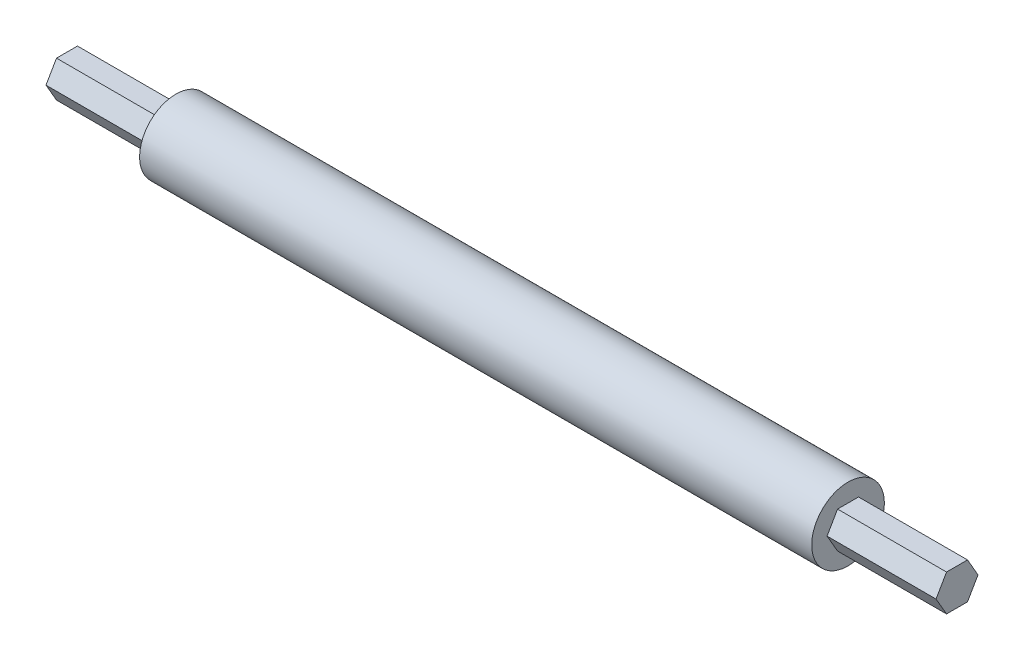
ISO-10303-21;
HEADER;
FILE_DESCRIPTION(('STEP AP214'),'2;1');
FILE_NAME('part.step','',(''),(''),'','','');
FILE_SCHEMA(('AUTOMOTIVE_DESIGN { 1 0 10303 214 1 1 1 1 }'));
ENDSEC;
DATA;
#1=APPLICATION_CONTEXT('core data for automotive mechanical design processes');
#2=APPLICATION_PROTOCOL_DEFINITION('international standard','automotive_design',2000,#1);
#3=PRODUCT_CONTEXT('',#1,'mechanical');
#4=PRODUCT('Part','Part','',(#3));
#5=PRODUCT_RELATED_PRODUCT_CATEGORY('part','',(#4));
#6=PRODUCT_DEFINITION_FORMATION('','',#4);
#7=PRODUCT_DEFINITION_CONTEXT('part definition',#1,'design');
#8=PRODUCT_DEFINITION('design','',#6,#7);
#9=PRODUCT_DEFINITION_SHAPE('','',#8);
#10=(LENGTH_UNIT() NAMED_UNIT(*) SI_UNIT(.MILLI.,.METRE.));
#11=(NAMED_UNIT(*) PLANE_ANGLE_UNIT() SI_UNIT($,.RADIAN.));
#12=(NAMED_UNIT(*) SI_UNIT($,.STERADIAN.) SOLID_ANGLE_UNIT());
#13=UNCERTAINTY_MEASURE_WITH_UNIT(LENGTH_MEASURE(1.E-05),#10,'distance_accuracy_value','');
#14=(GEOMETRIC_REPRESENTATION_CONTEXT(3) GLOBAL_UNCERTAINTY_ASSIGNED_CONTEXT((#13)) GLOBAL_UNIT_ASSIGNED_CONTEXT((#10,
#11,#12)) REPRESENTATION_CONTEXT('',''));
#15=CARTESIAN_POINT('',(0.,0.,0.));
#16=DIRECTION('',(0.,0.,1.));
#17=DIRECTION('',(1.,0.,0.));
#18=AXIS2_PLACEMENT_3D('',#15,#16,#17);
#19=CARTESIAN_POINT('',(155.575,0.,-7.33234841870825));
#20=DIRECTION('',(0.,-0.5,0.866025403784439));
#21=DIRECTION('',(0.,-0.866025403784439,-0.5));
#22=AXIS2_PLACEMENT_3D('',#19,#20,#21);
#23=PLANE('',#22);
#24=DIRECTION('',(-1.,0.,0.));
#25=VECTOR('',#24,1.);
#26=CARTESIAN_POINT('',(155.575,0.,-7.33234841870825));
#27=LINE('',#26,#25);
#28=CARTESIAN_POINT('',(155.575,0.,-7.33234841870825));
#29=VERTEX_POINT('',#28);
#30=CARTESIAN_POINT('',(117.475,0.,-7.33234841870825));
#31=VERTEX_POINT('',#30);
#32=EDGE_CURVE('E149',#29,#31,#27,.T.);
#33=ORIENTED_EDGE('',*,*,#32,.T.);
#34=DIRECTION('',(0.,0.866025403784439,0.5));
#35=VECTOR('',#34,1.);
#36=CARTESIAN_POINT('',(117.475,0.,-7.33234841870825));
#37=LINE('',#36,#35);
#38=CARTESIAN_POINT('',(117.475,6.35,-3.66617420935413));
#39=VERTEX_POINT('',#38);
#40=EDGE_CURVE('E214',#31,#39,#37,.T.);
#41=ORIENTED_EDGE('',*,*,#40,.T.);
#42=DIRECTION('',(-1.,0.,0.));
#43=VECTOR('',#42,1.);
#44=CARTESIAN_POINT('',(155.575,6.35,-3.66617420935413));
#45=LINE('',#44,#43);
#46=CARTESIAN_POINT('',(155.575,6.35,-3.66617420935413));
#47=VERTEX_POINT('',#46);
#48=EDGE_CURVE('E165',#47,#39,#45,.T.);
#49=ORIENTED_EDGE('',*,*,#48,.F.);
#50=DIRECTION('',(0.,0.866025403784439,0.5));
#51=VECTOR('',#50,1.);
#52=CARTESIAN_POINT('',(155.575,0.,-7.33234841870825));
#53=LINE('',#52,#51);
#54=EDGE_CURVE('E194',#29,#47,#53,.T.);
#55=ORIENTED_EDGE('',*,*,#54,.F.);
#56=EDGE_LOOP('',(#33,#41,#49,#55));
#57=FACE_BOUND('',#56,.T.);
#58=ADVANCED_FACE('F49',(#57),#23,.F.);
#59=CARTESIAN_POINT('',(155.575,6.35,-3.66617420935413));
#60=DIRECTION('',(0.,-1.,0.));
#61=DIRECTION('',(0.,0.,-1.));
#62=AXIS2_PLACEMENT_3D('',#59,#60,#61);
#63=PLANE('',#62);
#64=ORIENTED_EDGE('',*,*,#48,.T.);
#65=DIRECTION('',(0.,0.,1.));
#66=VECTOR('',#65,1.);
#67=CARTESIAN_POINT('',(117.475,6.35,-3.66617420935413));
#68=LINE('',#67,#66);
#69=CARTESIAN_POINT('',(117.475,6.35,3.66617420935412));
#70=VERTEX_POINT('',#69);
#71=EDGE_CURVE('E235',#39,#70,#68,.T.);
#72=ORIENTED_EDGE('',*,*,#71,.T.);
#73=DIRECTION('',(-1.,0.,0.));
#74=VECTOR('',#73,1.);
#75=CARTESIAN_POINT('',(155.575,6.35,3.66617420935412));
#76=LINE('',#75,#74);
#77=CARTESIAN_POINT('',(155.575,6.35,3.66617420935412));
#78=VERTEX_POINT('',#77);
#79=EDGE_CURVE('E170',#78,#70,#76,.T.);
#80=ORIENTED_EDGE('',*,*,#79,.F.);
#81=DIRECTION('',(0.,0.,1.));
#82=VECTOR('',#81,1.);
#83=CARTESIAN_POINT('',(155.575,6.35,-3.66617420935413));
#84=LINE('',#83,#82);
#85=EDGE_CURVE('E226',#47,#78,#84,.T.);
#86=ORIENTED_EDGE('',*,*,#85,.F.);
#87=EDGE_LOOP('',(#64,#72,#80,#86));
#88=FACE_BOUND('',#87,.T.);
#89=ADVANCED_FACE('F286',(#88),#63,.F.);
#90=CARTESIAN_POINT('',(155.575,6.35,3.66617420935412));
#91=DIRECTION('',(0.,-0.5,-0.866025403784438));
#92=DIRECTION('',(0.,0.866025403784439,-0.5));
#93=AXIS2_PLACEMENT_3D('',#90,#91,#92);
#94=PLANE('',#93);
#95=ORIENTED_EDGE('',*,*,#79,.T.);
#96=DIRECTION('',(0.,-0.866025403784439,0.5));
#97=VECTOR('',#96,1.);
#98=CARTESIAN_POINT('',(117.475,6.35,3.66617420935412));
#99=LINE('',#98,#97);
#100=CARTESIAN_POINT('',(117.475,0.,7.33234841870825));
#101=VERTEX_POINT('',#100);
#102=EDGE_CURVE('E239',#70,#101,#99,.T.);
#103=ORIENTED_EDGE('',*,*,#102,.T.);
#104=DIRECTION('',(-1.,0.,0.));
#105=VECTOR('',#104,1.);
#106=CARTESIAN_POINT('',(155.575,0.,7.33234841870825));
#107=LINE('',#106,#105);
#108=CARTESIAN_POINT('',(155.575,0.,7.33234841870825));
#109=VERTEX_POINT('',#108);
#110=EDGE_CURVE('E175',#109,#101,#107,.T.);
#111=ORIENTED_EDGE('',*,*,#110,.F.);
#112=DIRECTION('',(0.,-0.866025403784438,0.5));
#113=VECTOR('',#112,1.);
#114=CARTESIAN_POINT('',(155.575,6.35,3.66617420935412));
#115=LINE('',#114,#113);
#116=EDGE_CURVE('E223',#78,#109,#115,.T.);
#117=ORIENTED_EDGE('',*,*,#116,.F.);
#118=EDGE_LOOP('',(#95,#103,#111,#117));
#119=FACE_BOUND('',#118,.T.);
#120=ADVANCED_FACE('F292',(#119),#94,.F.);
#121=CARTESIAN_POINT('',(155.575,0.,7.33234841870825));
#122=DIRECTION('',(0.,0.5,-0.866025403784439));
#123=DIRECTION('',(0.,0.866025403784439,0.5));
#124=AXIS2_PLACEMENT_3D('',#121,#122,#123);
#125=PLANE('',#124);
#126=ORIENTED_EDGE('',*,*,#110,.T.);
#127=DIRECTION('',(0.,-0.866025403784439,-0.5));
#128=VECTOR('',#127,1.);
#129=CARTESIAN_POINT('',(117.475,0.,7.33234841870825));
#130=LINE('',#129,#128);
#131=CARTESIAN_POINT('',(117.475,-6.35,3.66617420935413));
#132=VERTEX_POINT('',#131);
#133=EDGE_CURVE('E243',#101,#132,#130,.T.);
#134=ORIENTED_EDGE('',*,*,#133,.T.);
#135=DIRECTION('',(-1.,0.,0.));
#136=VECTOR('',#135,1.);
#137=CARTESIAN_POINT('',(155.575,-6.35,3.66617420935413));
#138=LINE('',#137,#136);
#139=CARTESIAN_POINT('',(155.575,-6.35,3.66617420935413));
#140=VERTEX_POINT('',#139);
#141=EDGE_CURVE('E180',#140,#132,#138,.T.);
#142=ORIENTED_EDGE('',*,*,#141,.F.);
#143=DIRECTION('',(0.,-0.866025403784439,-0.5));
#144=VECTOR('',#143,1.);
#145=CARTESIAN_POINT('',(155.575,0.,7.33234841870825));
#146=LINE('',#145,#144);
#147=EDGE_CURVE('E220',#109,#140,#146,.T.);
#148=ORIENTED_EDGE('',*,*,#147,.F.);
#149=EDGE_LOOP('',(#126,#134,#142,#148));
#150=FACE_BOUND('',#149,.T.);
#151=ADVANCED_FACE('F307',(#150),#125,.F.);
#152=CARTESIAN_POINT('',(155.575,-6.35,3.66617420935413));
#153=DIRECTION('',(0.,1.,0.));
#154=DIRECTION('',(0.,0.,1.));
#155=AXIS2_PLACEMENT_3D('',#152,#153,#154);
#156=PLANE('',#155);
#157=ORIENTED_EDGE('',*,*,#141,.T.);
#158=DIRECTION('',(0.,0.,-1.));
#159=VECTOR('',#158,1.);
#160=CARTESIAN_POINT('',(117.475,-6.35,3.66617420935413));
#161=LINE('',#160,#159);
#162=CARTESIAN_POINT('',(117.475,-6.35,-3.66617420935412));
#163=VERTEX_POINT('',#162);
#164=EDGE_CURVE('E158',#132,#163,#161,.T.);
#165=ORIENTED_EDGE('',*,*,#164,.T.);
#166=DIRECTION('',(-1.,0.,0.));
#167=VECTOR('',#166,1.);
#168=CARTESIAN_POINT('',(155.575,-6.35,-3.66617420935412));
#169=LINE('',#168,#167);
#170=CARTESIAN_POINT('',(155.575,-6.35,-3.66617420935412));
#171=VERTEX_POINT('',#170);
#172=EDGE_CURVE('E185',#171,#163,#169,.T.);
#173=ORIENTED_EDGE('',*,*,#172,.F.);
#174=DIRECTION('',(0.,0.,-1.));
#175=VECTOR('',#174,1.);
#176=CARTESIAN_POINT('',(155.575,-6.35,3.66617420935413));
#177=LINE('',#176,#175);
#178=EDGE_CURVE('E217',#140,#171,#177,.T.);
#179=ORIENTED_EDGE('',*,*,#178,.F.);
#180=EDGE_LOOP('',(#157,#165,#173,#179));
#181=FACE_BOUND('',#180,.T.);
#182=ADVANCED_FACE('F311',(#181),#156,.F.);
#183=CARTESIAN_POINT('',(155.575,-6.35,-3.66617420935412));
#184=DIRECTION('',(0.,0.5,0.866025403784438));
#185=DIRECTION('',(0.,-0.866025403784439,0.5));
#186=AXIS2_PLACEMENT_3D('',#183,#184,#185);
#187=PLANE('',#186);
#188=ORIENTED_EDGE('',*,*,#172,.T.);
#189=DIRECTION('',(0.,0.866025403784439,-0.5));
#190=VECTOR('',#189,1.);
#191=CARTESIAN_POINT('',(117.475,-6.35,-3.66617420935412));
#192=LINE('',#191,#190);
#193=EDGE_CURVE('E11',#163,#31,#192,.T.);
#194=ORIENTED_EDGE('',*,*,#193,.T.);
#195=ORIENTED_EDGE('',*,*,#32,.F.);
#196=DIRECTION('',(0.,0.866025403784438,-0.5));
#197=VECTOR('',#196,1.);
#198=CARTESIAN_POINT('',(155.575,-6.35,-3.66617420935412));
#199=LINE('',#198,#197);
#200=EDGE_CURVE('E150',#171,#29,#199,.T.);
#201=ORIENTED_EDGE('',*,*,#200,.F.);
#202=EDGE_LOOP('',(#188,#194,#195,#201));
#203=FACE_BOUND('',#202,.T.);
#204=ADVANCED_FACE('F315',(#203),#187,.F.);
#205=CARTESIAN_POINT('',(155.575,0.,0.));
#206=DIRECTION('',(1.,0.,0.));
#207=DIRECTION('',(0.,0.,-1.));
#208=AXIS2_PLACEMENT_3D('',#205,#206,#207);
#209=PLANE('',#208);
#210=ORIENTED_EDGE('',*,*,#54,.T.);
#211=ORIENTED_EDGE('',*,*,#85,.T.);
#212=ORIENTED_EDGE('',*,*,#116,.T.);
#213=ORIENTED_EDGE('',*,*,#147,.T.);
#214=ORIENTED_EDGE('',*,*,#178,.T.);
#215=ORIENTED_EDGE('',*,*,#200,.T.);
#216=EDGE_LOOP('',(#210,#211,#212,#213,#214,#215));
#217=FACE_BOUND('',#216,.T.);
#218=ADVANCED_FACE('F283',(#217),#209,.T.);
#219=CARTESIAN_POINT('',(117.475,0.,0.));
#220=DIRECTION('',(1.,0.,0.));
#221=DIRECTION('',(0.,0.,-1.));
#222=AXIS2_PLACEMENT_3D('',#219,#220,#221);
#223=PLANE('',#222);
#224=CARTESIAN_POINT('',(117.475,0.,0.));
#225=DIRECTION('',(1.,0.,0.));
#226=DIRECTION('',(0.,0.,-1.));
#227=AXIS2_PLACEMENT_3D('',#224,#225,#226);
#228=CIRCLE('',#227,12.7);
#229=CARTESIAN_POINT('',(117.475,0.,-12.7));
#230=VERTEX_POINT('',#229);
#231=EDGE_CURVE('E259',#230,#230,#228,.T.);
#232=ORIENTED_EDGE('',*,*,#231,.T.);
#233=EDGE_LOOP('',(#232));
#234=FACE_BOUND('',#233,.T.);
#235=ORIENTED_EDGE('',*,*,#40,.F.);
#236=ORIENTED_EDGE('',*,*,#193,.F.);
#237=ORIENTED_EDGE('',*,*,#164,.F.);
#238=ORIENTED_EDGE('',*,*,#133,.F.);
#239=ORIENTED_EDGE('',*,*,#102,.F.);
#240=ORIENTED_EDGE('',*,*,#71,.F.);
#241=EDGE_LOOP('',(#235,#236,#237,#238,#239,#240));
#242=FACE_BOUND('',#241,.T.);
#243=ADVANCED_FACE('F268',(#234,#242),#223,.T.);
#244=CARTESIAN_POINT('',(-117.475,0.,0.));
#245=DIRECTION('',(1.,0.,0.));
#246=DIRECTION('',(0.,0.,-1.));
#247=AXIS2_PLACEMENT_3D('',#244,#245,#246);
#248=PLANE('',#247);
#249=CARTESIAN_POINT('',(-117.475,0.,0.));
#250=DIRECTION('',(1.,0.,0.));
#251=DIRECTION('',(0.,0.,-1.));
#252=AXIS2_PLACEMENT_3D('',#249,#250,#251);
#253=CIRCLE('',#252,12.7);
#254=CARTESIAN_POINT('',(-117.475,0.,-12.7));
#255=VERTEX_POINT('',#254);
#256=EDGE_CURVE('E260',#255,#255,#253,.T.);
#257=ORIENTED_EDGE('',*,*,#256,.F.);
#258=EDGE_LOOP('',(#257));
#259=FACE_BOUND('',#258,.T.);
#260=DIRECTION('',(0.,0.866025403784439,-0.5));
#261=VECTOR('',#260,1.);
#262=CARTESIAN_POINT('',(-117.475,-6.35,-3.66617420935412));
#263=LINE('',#262,#261);
#264=CARTESIAN_POINT('',(-117.475,-6.35,-3.66617420935412));
#265=VERTEX_POINT('',#264);
#266=CARTESIAN_POINT('',(-117.475,0.,-7.33234841870825));
#267=VERTEX_POINT('',#266);
#268=EDGE_CURVE('E57',#265,#267,#263,.T.);
#269=ORIENTED_EDGE('',*,*,#268,.T.);
#270=DIRECTION('',(0.,0.866025403784439,0.5));
#271=VECTOR('',#270,1.);
#272=CARTESIAN_POINT('',(-117.475,0.,-7.33234841870825));
#273=LINE('',#272,#271);
#274=CARTESIAN_POINT('',(-117.475,6.35,-3.66617420935413));
#275=VERTEX_POINT('',#274);
#276=EDGE_CURVE('E153',#267,#275,#273,.T.);
#277=ORIENTED_EDGE('',*,*,#276,.T.);
#278=DIRECTION('',(0.,0.,1.));
#279=VECTOR('',#278,1.);
#280=CARTESIAN_POINT('',(-117.475,6.35,-3.66617420935413));
#281=LINE('',#280,#279);
#282=CARTESIAN_POINT('',(-117.475,6.35,3.66617420935412));
#283=VERTEX_POINT('',#282);
#284=EDGE_CURVE('E64',#275,#283,#281,.T.);
#285=ORIENTED_EDGE('',*,*,#284,.T.);
#286=DIRECTION('',(0.,-0.866025403784439,0.5));
#287=VECTOR('',#286,1.);
#288=CARTESIAN_POINT('',(-117.475,6.35,3.66617420935412));
#289=LINE('',#288,#287);
#290=CARTESIAN_POINT('',(-117.475,0.,7.33234841870825));
#291=VERTEX_POINT('',#290);
#292=EDGE_CURVE('E72',#283,#291,#289,.T.);
#293=ORIENTED_EDGE('',*,*,#292,.T.);
#294=DIRECTION('',(0.,-0.866025403784439,-0.5));
#295=VECTOR('',#294,1.);
#296=CARTESIAN_POINT('',(-117.475,0.,7.33234841870825));
#297=LINE('',#296,#295);
#298=CARTESIAN_POINT('',(-117.475,-6.35,3.66617420935413));
#299=VERTEX_POINT('',#298);
#300=EDGE_CURVE('E254',#291,#299,#297,.T.);
#301=ORIENTED_EDGE('',*,*,#300,.T.);
#302=DIRECTION('',(0.,0.,-1.));
#303=VECTOR('',#302,1.);
#304=CARTESIAN_POINT('',(-117.475,-6.35,3.66617420935413));
#305=LINE('',#304,#303);
#306=EDGE_CURVE('E163',#299,#265,#305,.T.);
#307=ORIENTED_EDGE('',*,*,#306,.T.);
#308=EDGE_LOOP('',(#269,#277,#285,#293,#301,#307));
#309=FACE_BOUND('',#308,.T.);
#310=ADVANCED_FACE('F161',(#259,#309),#248,.F.);
#311=CARTESIAN_POINT('',(117.475,0.,0.));
#312=DIRECTION('',(-1.,0.,0.));
#313=DIRECTION('',(0.,0.,1.));
#314=AXIS2_PLACEMENT_3D('',#311,#312,#313);
#315=CYLINDRICAL_SURFACE('',#314,12.7);
#316=ORIENTED_EDGE('',*,*,#231,.F.);
#317=EDGE_LOOP('',(#316));
#318=FACE_BOUND('',#317,.T.);
#319=ORIENTED_EDGE('',*,*,#256,.T.);
#320=EDGE_LOOP('',(#319));
#321=FACE_BOUND('',#320,.T.);
#322=ADVANCED_FACE('F271',(#318,#321),#315,.T.);
#323=CARTESIAN_POINT('',(-155.575,0.,0.));
#324=DIRECTION('',(1.,0.,0.));
#325=DIRECTION('',(0.,0.,-1.));
#326=AXIS2_PLACEMENT_3D('',#323,#324,#325);
#327=PLANE('',#326);
#328=DIRECTION('',(0.,0.866025403784439,0.5));
#329=VECTOR('',#328,1.);
#330=CARTESIAN_POINT('',(-155.575,0.,-7.33234841870825));
#331=LINE('',#330,#329);
#332=CARTESIAN_POINT('',(-155.575,0.,-7.33234841870825));
#333=VERTEX_POINT('',#332);
#334=CARTESIAN_POINT('',(-155.575,6.35,-3.66617420935413));
#335=VERTEX_POINT('',#334);
#336=EDGE_CURVE('E211',#333,#335,#331,.T.);
#337=ORIENTED_EDGE('',*,*,#336,.F.);
#338=DIRECTION('',(0.,0.866025403784438,-0.5));
#339=VECTOR('',#338,1.);
#340=CARTESIAN_POINT('',(-155.575,-6.35,-3.66617420935412));
#341=LINE('',#340,#339);
#342=CARTESIAN_POINT('',(-155.575,-6.35,-3.66617420935412));
#343=VERTEX_POINT('',#342);
#344=EDGE_CURVE('E144',#343,#333,#341,.T.);
#345=ORIENTED_EDGE('',*,*,#344,.F.);
#346=DIRECTION('',(0.,0.,-1.));
#347=VECTOR('',#346,1.);
#348=CARTESIAN_POINT('',(-155.575,-6.35,3.66617420935413));
#349=LINE('',#348,#347);
#350=CARTESIAN_POINT('',(-155.575,-6.35,3.66617420935413));
#351=VERTEX_POINT('',#350);
#352=EDGE_CURVE('E195',#351,#343,#349,.T.);
#353=ORIENTED_EDGE('',*,*,#352,.F.);
#354=DIRECTION('',(0.,-0.866025403784439,-0.5));
#355=VECTOR('',#354,1.);
#356=CARTESIAN_POINT('',(-155.575,0.,7.33234841870825));
#357=LINE('',#356,#355);
#358=CARTESIAN_POINT('',(-155.575,0.,7.33234841870825));
#359=VERTEX_POINT('',#358);
#360=EDGE_CURVE('E199',#359,#351,#357,.T.);
#361=ORIENTED_EDGE('',*,*,#360,.F.);
#362=DIRECTION('',(0.,-0.866025403784438,0.5));
#363=VECTOR('',#362,1.);
#364=CARTESIAN_POINT('',(-155.575,6.35,3.66617420935412));
#365=LINE('',#364,#363);
#366=CARTESIAN_POINT('',(-155.575,6.35,3.66617420935412));
#367=VERTEX_POINT('',#366);
#368=EDGE_CURVE('E203',#367,#359,#365,.T.);
#369=ORIENTED_EDGE('',*,*,#368,.F.);
#370=DIRECTION('',(0.,0.,1.));
#371=VECTOR('',#370,1.);
#372=CARTESIAN_POINT('',(-155.575,6.35,-3.66617420935413));
#373=LINE('',#372,#371);
#374=EDGE_CURVE('E207',#335,#367,#373,.T.);
#375=ORIENTED_EDGE('',*,*,#374,.F.);
#376=EDGE_LOOP('',(#337,#345,#353,#361,#369,#375));
#377=FACE_BOUND('',#376,.T.);
#378=ADVANCED_FACE('F274',(#377),#327,.F.);
#379=ORIENTED_EDGE('',*,*,#268,.F.);
#380=EDGE_CURVE('E188',#265,#343,#169,.T.);
#381=ORIENTED_EDGE('',*,*,#380,.T.);
#382=ORIENTED_EDGE('',*,*,#344,.T.);
#383=EDGE_CURVE('E138',#267,#333,#27,.T.);
#384=ORIENTED_EDGE('',*,*,#383,.F.);
#385=EDGE_LOOP('',(#379,#381,#382,#384));
#386=FACE_BOUND('',#385,.T.);
#387=ADVANCED_FACE('F140',(#386),#187,.F.);
#388=ORIENTED_EDGE('',*,*,#306,.F.);
#389=EDGE_CURVE('E184',#299,#351,#138,.T.);
#390=ORIENTED_EDGE('',*,*,#389,.T.);
#391=ORIENTED_EDGE('',*,*,#352,.T.);
#392=ORIENTED_EDGE('',*,*,#380,.F.);
#393=EDGE_LOOP('',(#388,#390,#391,#392));
#394=FACE_BOUND('',#393,.T.);
#395=ADVANCED_FACE('F317',(#394),#156,.F.);
#396=ORIENTED_EDGE('',*,*,#300,.F.);
#397=EDGE_CURVE('E179',#291,#359,#107,.T.);
#398=ORIENTED_EDGE('',*,*,#397,.T.);
#399=ORIENTED_EDGE('',*,*,#360,.T.);
#400=ORIENTED_EDGE('',*,*,#389,.F.);
#401=EDGE_LOOP('',(#396,#398,#399,#400));
#402=FACE_BOUND('',#401,.T.);
#403=ADVANCED_FACE('F303',(#402),#125,.F.);
#404=ORIENTED_EDGE('',*,*,#292,.F.);
#405=EDGE_CURVE('E174',#283,#367,#76,.T.);
#406=ORIENTED_EDGE('',*,*,#405,.T.);
#407=ORIENTED_EDGE('',*,*,#368,.T.);
#408=ORIENTED_EDGE('',*,*,#397,.F.);
#409=EDGE_LOOP('',(#404,#406,#407,#408));
#410=FACE_BOUND('',#409,.T.);
#411=ADVANCED_FACE('F299',(#410),#94,.F.);
#412=ORIENTED_EDGE('',*,*,#284,.F.);
#413=EDGE_CURVE('E155',#275,#335,#45,.T.);
#414=ORIENTED_EDGE('',*,*,#413,.T.);
#415=ORIENTED_EDGE('',*,*,#374,.T.);
#416=ORIENTED_EDGE('',*,*,#405,.F.);
#417=EDGE_LOOP('',(#412,#414,#415,#416));
#418=FACE_BOUND('',#417,.T.);
#419=ADVANCED_FACE('F294',(#418),#63,.F.);
#420=ORIENTED_EDGE('',*,*,#276,.F.);
#421=ORIENTED_EDGE('',*,*,#383,.T.);
#422=ORIENTED_EDGE('',*,*,#336,.T.);
#423=ORIENTED_EDGE('',*,*,#413,.F.);
#424=EDGE_LOOP('',(#420,#421,#422,#423));
#425=FACE_BOUND('',#424,.T.);
#426=ADVANCED_FACE('F154',(#425),#23,.F.);
#427=CLOSED_SHELL('',(#58,#89,#120,#151,#182,#204,#218,#243,#310,#322,#378,#387,#395,#403,#411,
#419,#426));
#428=MANIFOLD_SOLID_BREP('B2',#427);
#429=ADVANCED_BREP_SHAPE_REPRESENTATION('',(#18,#428),#14);
#430=SHAPE_DEFINITION_REPRESENTATION(#9,#429);
ENDSEC;
END-ISO-10303-21;
